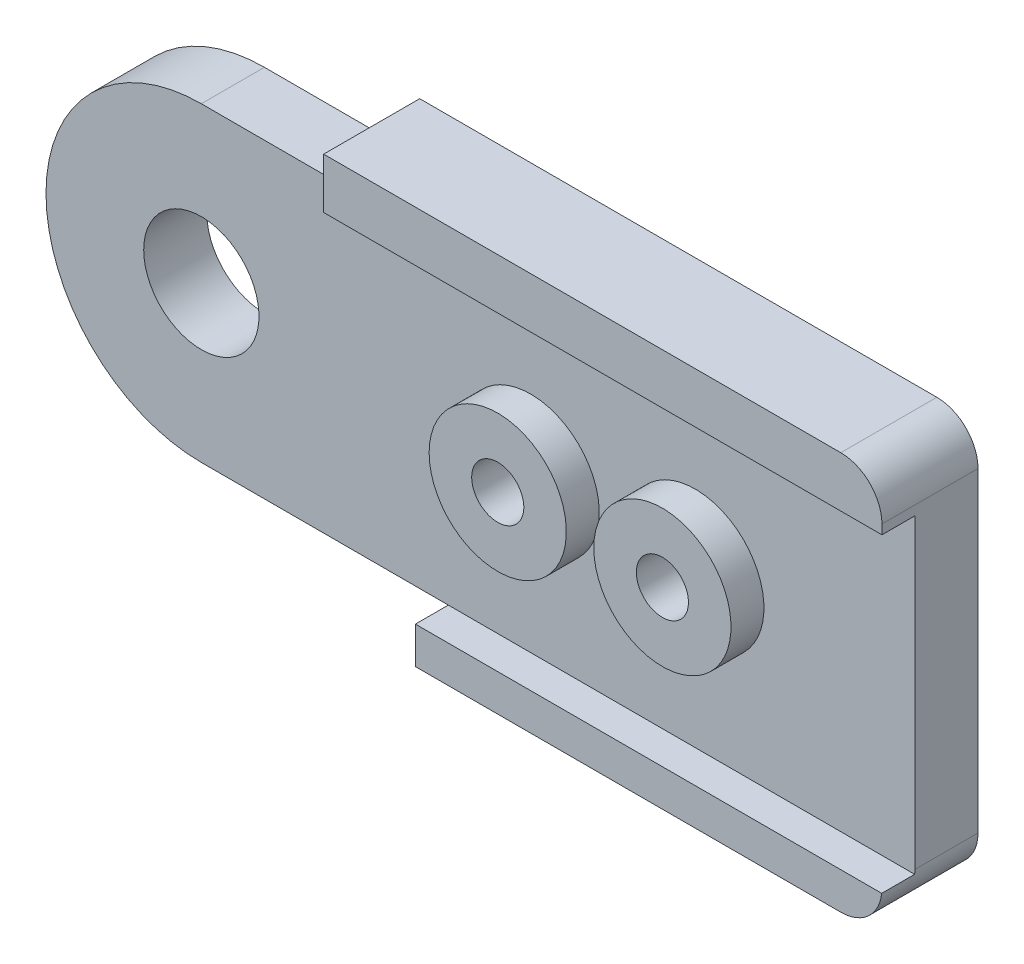
ISO-10303-21;
HEADER;
FILE_DESCRIPTION(('STEP AP214'),'2;1');
FILE_NAME('part.step','',(''),(''),'','','');
FILE_SCHEMA(('AUTOMOTIVE_DESIGN { 1 0 10303 214 1 1 1 1 }'));
ENDSEC;
DATA;
#1=APPLICATION_CONTEXT('core data for automotive mechanical design processes');
#2=APPLICATION_PROTOCOL_DEFINITION('international standard','automotive_design',2000,#1);
#3=PRODUCT_CONTEXT('',#1,'mechanical');
#4=PRODUCT('Part','Part','',(#3));
#5=PRODUCT_RELATED_PRODUCT_CATEGORY('part','',(#4));
#6=PRODUCT_DEFINITION_FORMATION('','',#4);
#7=PRODUCT_DEFINITION_CONTEXT('part definition',#1,'design');
#8=PRODUCT_DEFINITION('design','',#6,#7);
#9=PRODUCT_DEFINITION_SHAPE('','',#8);
#10=(LENGTH_UNIT() NAMED_UNIT(*) SI_UNIT(.MILLI.,.METRE.));
#11=(NAMED_UNIT(*) PLANE_ANGLE_UNIT() SI_UNIT($,.RADIAN.));
#12=(NAMED_UNIT(*) SI_UNIT($,.STERADIAN.) SOLID_ANGLE_UNIT());
#13=UNCERTAINTY_MEASURE_WITH_UNIT(LENGTH_MEASURE(1.E-05),#10,'distance_accuracy_value','');
#14=(GEOMETRIC_REPRESENTATION_CONTEXT(3) GLOBAL_UNCERTAINTY_ASSIGNED_CONTEXT((#13)) GLOBAL_UNIT_ASSIGNED_CONTEXT((#10,
#11,#12)) REPRESENTATION_CONTEXT('',''));
#15=CARTESIAN_POINT('',(0.,0.,0.));
#16=DIRECTION('',(0.,0.,1.));
#17=DIRECTION('',(1.,0.,0.));
#18=AXIS2_PLACEMENT_3D('',#15,#16,#17);
#19=CARTESIAN_POINT('',(0.,0.,-9.5));
#20=DIRECTION('',(0.,0.,-1.));
#21=DIRECTION('',(-1.,0.,0.));
#22=AXIS2_PLACEMENT_3D('',#19,#20,#21);
#23=PLANE('',#22);
#24=DIRECTION('',(0.999999845465009,-0.000555940607591913,0.));
#25=VECTOR('',#24,1.);
#26=CARTESIAN_POINT('',(0.00314662286624039,5.65999737563121,-9.5));
#27=LINE('',#26,#25);
#28=CARTESIAN_POINT('',(0.,5.65999912496691,-9.5));
#29=VERTEX_POINT('',#28);
#30=CARTESIAN_POINT('',(5.65685424949238,5.65685424949239,-9.5));
#31=VERTEX_POINT('',#30);
#32=EDGE_CURVE('E226',#29,#31,#27,.T.);
#33=ORIENTED_EDGE('',*,*,#32,.T.);
#34=DIRECTION('',(0.,1.,0.));
#35=VECTOR('',#34,1.);
#36=CARTESIAN_POINT('',(5.65685424949238,5.65685424949239,-9.5));
#37=LINE('',#36,#35);
#38=CARTESIAN_POINT('',(5.65685424949238,7.49836473471238,-9.5));
#39=VERTEX_POINT('',#38);
#40=EDGE_CURVE('E166',#31,#39,#37,.T.);
#41=ORIENTED_EDGE('',*,*,#40,.T.);
#42=DIRECTION('',(1.,0.,0.));
#43=VECTOR('',#42,1.);
#44=CARTESIAN_POINT('',(5.65685424949238,7.49836473471238,-9.5));
#45=LINE('',#44,#43);
#46=CARTESIAN_POINT('',(24.5,7.49836473471239,-9.5));
#47=VERTEX_POINT('',#46);
#48=EDGE_CURVE('E162',#39,#47,#45,.T.);
#49=ORIENTED_EDGE('',*,*,#48,.T.);
#50=CARTESIAN_POINT('',(24.5,5.99836473471239,-9.5));
#51=DIRECTION('',(0.,0.,-1.));
#52=DIRECTION('',(-1.,0.,0.));
#53=AXIS2_PLACEMENT_3D('',#50,#51,#52);
#54=CIRCLE('',#53,1.5);
#55=CARTESIAN_POINT('',(26.,5.99836473471239,-9.5));
#56=VERTEX_POINT('',#55);
#57=EDGE_CURVE('E137',#56,#47,#54,.F.);
#58=ORIENTED_EDGE('',*,*,#57,.F.);
#59=DIRECTION('',(0.,-1.,0.));
#60=VECTOR('',#59,1.);
#61=CARTESIAN_POINT('',(26.,0.,-9.5));
#62=LINE('',#61,#60);
#63=CARTESIAN_POINT('',(26.,-5.50163526528755,-9.5));
#64=VERTEX_POINT('',#63);
#65=EDGE_CURVE('E104',#56,#64,#62,.T.);
#66=ORIENTED_EDGE('',*,*,#65,.T.);
#67=CARTESIAN_POINT('',(24.5,-5.50163526528755,-9.5));
#68=DIRECTION('',(0.,0.,-1.));
#69=DIRECTION('',(-1.,0.,0.));
#70=AXIS2_PLACEMENT_3D('',#67,#68,#69);
#71=CIRCLE('',#70,1.5);
#72=CARTESIAN_POINT('',(24.5,-7.00163526528755,-9.5));
#73=VERTEX_POINT('',#72);
#74=EDGE_CURVE('E142',#73,#64,#71,.F.);
#75=ORIENTED_EDGE('',*,*,#74,.F.);
#76=DIRECTION('',(-1.,0.,0.));
#77=VECTOR('',#76,1.);
#78=CARTESIAN_POINT('',(26.,-7.00163526528755,-9.5));
#79=LINE('',#78,#77);
#80=CARTESIAN_POINT('',(9.00000000000001,-7.00163526528755,-9.5));
#81=VERTEX_POINT('',#80);
#82=EDGE_CURVE('E158',#73,#81,#79,.T.);
#83=ORIENTED_EDGE('',*,*,#82,.T.);
#84=DIRECTION('',(0.,1.,0.));
#85=VECTOR('',#84,1.);
#86=CARTESIAN_POINT('',(9.00000000000001,-7.00163526528755,-9.5));
#87=LINE('',#86,#85);
#88=CARTESIAN_POINT('',(9.00000000000001,-5.6599991249669,-9.5));
#89=VERTEX_POINT('',#88);
#90=EDGE_CURVE('E154',#81,#89,#87,.T.);
#91=ORIENTED_EDGE('',*,*,#90,.T.);
#92=DIRECTION('',(-1.,0.,0.));
#93=VECTOR('',#92,1.);
#94=CARTESIAN_POINT('',(0.,-5.6599991249669,-9.5));
#95=LINE('',#94,#93);
#96=CARTESIAN_POINT('',(0.,-5.6599991249669,-9.5));
#97=VERTEX_POINT('',#96);
#98=EDGE_CURVE('E123',#89,#97,#95,.T.);
#99=ORIENTED_EDGE('',*,*,#98,.T.);
#100=CARTESIAN_POINT('',(0.,0.,-9.5));
#101=DIRECTION('',(0.,0.,-1.));
#102=DIRECTION('',(-1.,0.,0.));
#103=AXIS2_PLACEMENT_3D('',#100,#101,#102);
#104=CIRCLE('',#103,5.65999868763295);
#105=EDGE_CURVE('E90',#97,#29,#104,.T.);
#106=ORIENTED_EDGE('',*,*,#105,.T.);
#107=EDGE_LOOP('',(#33,#41,#49,#58,#66,#75,#83,#91,#99,#106));
#108=FACE_BOUND('',#107,.T.);
#109=CARTESIAN_POINT('',(18.,0.,-9.5));
#110=DIRECTION('',(0.,0.,-1.));
#111=DIRECTION('',(-1.,0.,0.));
#112=AXIS2_PLACEMENT_3D('',#109,#110,#111);
#113=CIRCLE('',#112,0.950000000000001);
#114=CARTESIAN_POINT('',(17.05,0.,-9.5));
#115=VERTEX_POINT('',#114);
#116=EDGE_CURVE('E146',#115,#115,#113,.F.);
#117=ORIENTED_EDGE('',*,*,#116,.T.);
#118=EDGE_LOOP('',(#117));
#119=FACE_BOUND('',#118,.T.);
#120=CARTESIAN_POINT('',(12.,0.,-9.5));
#121=DIRECTION('',(0.,0.,-1.));
#122=DIRECTION('',(-1.,0.,0.));
#123=AXIS2_PLACEMENT_3D('',#120,#121,#122);
#124=CIRCLE('',#123,0.949999999999999);
#125=CARTESIAN_POINT('',(11.05,0.,-9.5));
#126=VERTEX_POINT('',#125);
#127=EDGE_CURVE('E150',#126,#126,#124,.F.);
#128=ORIENTED_EDGE('',*,*,#127,.T.);
#129=EDGE_LOOP('',(#128));
#130=FACE_BOUND('',#129,.T.);
#131=CARTESIAN_POINT('',(0.,0.,-9.5));
#132=DIRECTION('',(0.,0.,-1.));
#133=DIRECTION('',(-1.,0.,0.));
#134=AXIS2_PLACEMENT_3D('',#131,#132,#133);
#135=CIRCLE('',#134,2.1);
#136=CARTESIAN_POINT('',(-2.1,0.,-9.5));
#137=VERTEX_POINT('',#136);
#138=EDGE_CURVE('E118',#137,#137,#135,.T.);
#139=ORIENTED_EDGE('',*,*,#138,.F.);
#140=EDGE_LOOP('',(#139));
#141=FACE_BOUND('',#140,.T.);
#142=ADVANCED_FACE('F40',(#108,#119,#130,#141),#23,.T.);
#143=CARTESIAN_POINT('',(12.,0.,-6.));
#144=DIRECTION('',(0.,0.,1.));
#145=DIRECTION('',(1.,0.,0.));
#146=AXIS2_PLACEMENT_3D('',#143,#144,#145);
#147=CYLINDRICAL_SURFACE('',#146,2.5);
#148=CARTESIAN_POINT('',(12.,0.,-6.));
#149=DIRECTION('',(0.,0.,-1.));
#150=DIRECTION('',(-1.,0.,0.));
#151=AXIS2_PLACEMENT_3D('',#148,#149,#150);
#152=CIRCLE('',#151,2.5);
#153=CARTESIAN_POINT('',(9.50000000000001,0.,-6.));
#154=VERTEX_POINT('',#153);
#155=EDGE_CURVE('E386',#154,#154,#152,.T.);
#156=ORIENTED_EDGE('',*,*,#155,.T.);
#157=EDGE_LOOP('',(#156));
#158=FACE_BOUND('',#157,.T.);
#159=CARTESIAN_POINT('',(12.,0.,-7.2));
#160=DIRECTION('',(0.,0.,-1.));
#161=DIRECTION('',(-1.,0.,0.));
#162=AXIS2_PLACEMENT_3D('',#159,#160,#161);
#163=CIRCLE('',#162,2.5);
#164=CARTESIAN_POINT('',(9.50000000000001,0.,-7.2));
#165=VERTEX_POINT('',#164);
#166=EDGE_CURVE('E127',#165,#165,#163,.T.);
#167=ORIENTED_EDGE('',*,*,#166,.F.);
#168=EDGE_LOOP('',(#167));
#169=FACE_BOUND('',#168,.T.);
#170=ADVANCED_FACE('F304',(#158,#169),#147,.T.);
#171=CARTESIAN_POINT('',(18.,0.,-6.));
#172=DIRECTION('',(0.,0.,1.));
#173=DIRECTION('',(1.,0.,0.));
#174=AXIS2_PLACEMENT_3D('',#171,#172,#173);
#175=CYLINDRICAL_SURFACE('',#174,2.5);
#176=CARTESIAN_POINT('',(18.,0.,-6.));
#177=DIRECTION('',(0.,0.,-1.));
#178=DIRECTION('',(-1.,0.,0.));
#179=AXIS2_PLACEMENT_3D('',#176,#177,#178);
#180=CIRCLE('',#179,2.5);
#181=CARTESIAN_POINT('',(15.5,0.,-6.));
#182=VERTEX_POINT('',#181);
#183=EDGE_CURVE('E380',#182,#182,#180,.T.);
#184=ORIENTED_EDGE('',*,*,#183,.T.);
#185=EDGE_LOOP('',(#184));
#186=FACE_BOUND('',#185,.T.);
#187=CARTESIAN_POINT('',(18.,0.,-7.2));
#188=DIRECTION('',(0.,0.,-1.));
#189=DIRECTION('',(-1.,0.,0.));
#190=AXIS2_PLACEMENT_3D('',#187,#188,#189);
#191=CIRCLE('',#190,2.5);
#192=CARTESIAN_POINT('',(15.5,0.,-7.2));
#193=VERTEX_POINT('',#192);
#194=EDGE_CURVE('E131',#193,#193,#191,.T.);
#195=ORIENTED_EDGE('',*,*,#194,.F.);
#196=EDGE_LOOP('',(#195));
#197=FACE_BOUND('',#196,.T.);
#198=ADVANCED_FACE('F306',(#186,#197),#175,.T.);
#199=CARTESIAN_POINT('',(0.,0.,-6.));
#200=DIRECTION('',(0.,0.,-1.));
#201=DIRECTION('',(-1.,0.,0.));
#202=AXIS2_PLACEMENT_3D('',#199,#200,#201);
#203=PLANE('',#202);
#204=DIRECTION('',(-1.,0.,0.));
#205=VECTOR('',#204,1.);
#206=CARTESIAN_POINT('',(26.,-7.00163526528755,-6.));
#207=LINE('',#206,#205);
#208=CARTESIAN_POINT('',(24.5,-7.00163526528755,-6.));
#209=VERTEX_POINT('',#208);
#210=CARTESIAN_POINT('',(9.00000000000001,-7.00163526528755,-6.));
#211=VERTEX_POINT('',#210);
#212=EDGE_CURVE('E373',#209,#211,#207,.T.);
#213=ORIENTED_EDGE('',*,*,#212,.F.);
#214=CARTESIAN_POINT('',(24.5,-5.50163526528755,-6.));
#215=DIRECTION('',(0.,0.,-1.));
#216=DIRECTION('',(-1.,0.,0.));
#217=AXIS2_PLACEMENT_3D('',#214,#215,#216);
#218=CIRCLE('',#217,1.5);
#219=CARTESIAN_POINT('',(25.9916168703616,-5.6599991249669,-6.));
#220=VERTEX_POINT('',#219);
#221=EDGE_CURVE('E393',#209,#220,#218,.F.);
#222=ORIENTED_EDGE('',*,*,#221,.T.);
#223=DIRECTION('',(1.,0.,0.));
#224=VECTOR('',#223,1.);
#225=CARTESIAN_POINT('',(9.00000000000001,-5.6599991249669,-6.));
#226=LINE('',#225,#224);
#227=CARTESIAN_POINT('',(9.00000000000001,-5.6599991249669,-6.));
#228=VERTEX_POINT('',#227);
#229=EDGE_CURVE('E175',#228,#220,#226,.T.);
#230=ORIENTED_EDGE('',*,*,#229,.F.);
#231=DIRECTION('',(0.,1.,0.));
#232=VECTOR('',#231,1.);
#233=CARTESIAN_POINT('',(9.00000000000001,-7.00163526528755,-6.));
#234=LINE('',#233,#232);
#235=EDGE_CURVE('E408',#211,#228,#234,.T.);
#236=ORIENTED_EDGE('',*,*,#235,.F.);
#237=EDGE_LOOP('',(#213,#222,#230,#236));
#238=FACE_BOUND('',#237,.T.);
#239=ADVANCED_FACE('F313',(#238),#203,.F.);
#240=CARTESIAN_POINT('',(9.00000000000001,-5.6599991249669,-6.));
#241=DIRECTION('',(0.,-1.,0.));
#242=DIRECTION('',(1.,0.,0.));
#243=AXIS2_PLACEMENT_3D('',#240,#241,#242);
#244=PLANE('',#243);
#245=DIRECTION('',(0.,0.,1.));
#246=VECTOR('',#245,1.);
#247=CARTESIAN_POINT('',(9.00000000000001,-5.6599991249669,-6.));
#248=LINE('',#247,#246);
#249=CARTESIAN_POINT('',(9.00000000000001,-5.6599991249669,-7.2));
#250=VERTEX_POINT('',#249);
#251=EDGE_CURVE('E203',#250,#228,#248,.T.);
#252=ORIENTED_EDGE('',*,*,#251,.T.);
#253=ORIENTED_EDGE('',*,*,#229,.T.);
#254=DIRECTION('',(0.,0.,-1.));
#255=VECTOR('',#254,1.);
#256=CARTESIAN_POINT('',(25.9916168703616,-5.6599991249669,-4.8));
#257=LINE('',#256,#255);
#258=CARTESIAN_POINT('',(25.9916168703616,-5.6599991249669,-7.2));
#259=VERTEX_POINT('',#258);
#260=EDGE_CURVE('E179',#220,#259,#257,.T.);
#261=ORIENTED_EDGE('',*,*,#260,.T.);
#262=DIRECTION('',(1.,0.,0.));
#263=VECTOR('',#262,1.);
#264=CARTESIAN_POINT('',(9.00000000000001,-5.6599991249669,-7.2));
#265=LINE('',#264,#263);
#266=EDGE_CURVE('E11',#250,#259,#265,.T.);
#267=ORIENTED_EDGE('',*,*,#266,.F.);
#268=EDGE_LOOP('',(#252,#253,#261,#267));
#269=FACE_BOUND('',#268,.T.);
#270=ADVANCED_FACE('F329',(#269),#244,.F.);
#271=CARTESIAN_POINT('',(26.,-7.00163526528755,2.));
#272=DIRECTION('',(0.,1.,0.));
#273=DIRECTION('',(-1.,0.,0.));
#274=AXIS2_PLACEMENT_3D('',#271,#272,#273);
#275=PLANE('',#274);
#276=ORIENTED_EDGE('',*,*,#82,.F.);
#277=DIRECTION('',(0.,0.,-1.));
#278=VECTOR('',#277,1.);
#279=CARTESIAN_POINT('',(24.5,-7.00163526528755,2.));
#280=LINE('',#279,#278);
#281=EDGE_CURVE('E174',#73,#209,#280,.F.);
#282=ORIENTED_EDGE('',*,*,#281,.T.);
#283=ORIENTED_EDGE('',*,*,#212,.T.);
#284=DIRECTION('',(0.,0.,-1.));
#285=VECTOR('',#284,1.);
#286=CARTESIAN_POINT('',(9.00000000000001,-7.00163526528755,2.));
#287=LINE('',#286,#285);
#288=EDGE_CURVE('E184',#211,#81,#287,.T.);
#289=ORIENTED_EDGE('',*,*,#288,.T.);
#290=EDGE_LOOP('',(#276,#282,#283,#289));
#291=FACE_BOUND('',#290,.T.);
#292=ADVANCED_FACE('F331',(#291),#275,.F.);
#293=CARTESIAN_POINT('',(5.65685424949238,7.49836473471238,2.));
#294=DIRECTION('',(0.,-1.,0.));
#295=DIRECTION('',(1.,0.,0.));
#296=AXIS2_PLACEMENT_3D('',#293,#294,#295);
#297=PLANE('',#296);
#298=ORIENTED_EDGE('',*,*,#48,.F.);
#299=DIRECTION('',(0.,0.,-1.));
#300=VECTOR('',#299,1.);
#301=CARTESIAN_POINT('',(5.65685424949238,7.49836473471238,2.));
#302=LINE('',#301,#300);
#303=CARTESIAN_POINT('',(5.65685424949238,7.49836473471238,-6.));
#304=VERTEX_POINT('',#303);
#305=EDGE_CURVE('E187',#304,#39,#302,.T.);
#306=ORIENTED_EDGE('',*,*,#305,.F.);
#307=DIRECTION('',(1.,0.,0.));
#308=VECTOR('',#307,1.);
#309=CARTESIAN_POINT('',(5.65685424949238,7.49836473471238,-6.));
#310=LINE('',#309,#308);
#311=CARTESIAN_POINT('',(24.5,7.49836473471239,-6.));
#312=VERTEX_POINT('',#311);
#313=EDGE_CURVE('E372',#304,#312,#310,.T.);
#314=ORIENTED_EDGE('',*,*,#313,.T.);
#315=DIRECTION('',(0.,0.,-1.));
#316=VECTOR('',#315,1.);
#317=CARTESIAN_POINT('',(24.5,7.49836473471239,2.));
#318=LINE('',#317,#316);
#319=EDGE_CURVE('E170',#312,#47,#318,.T.);
#320=ORIENTED_EDGE('',*,*,#319,.T.);
#321=EDGE_LOOP('',(#298,#306,#314,#320));
#322=FACE_BOUND('',#321,.T.);
#323=ADVANCED_FACE('F353',(#322),#297,.F.);
#324=CARTESIAN_POINT('',(24.5,-5.50163526528755,2.));
#325=DIRECTION('',(0.,0.,-1.));
#326=DIRECTION('',(-1.,0.,0.));
#327=AXIS2_PLACEMENT_3D('',#324,#325,#326);
#328=CYLINDRICAL_SURFACE('',#327,1.5);
#329=ORIENTED_EDGE('',*,*,#281,.F.);
#330=ORIENTED_EDGE('',*,*,#74,.T.);
#331=DIRECTION('',(0.,0.,1.));
#332=VECTOR('',#331,1.);
#333=CARTESIAN_POINT('',(26.,-5.50163526528755,-14.));
#334=LINE('',#333,#332);
#335=CARTESIAN_POINT('',(26.,-5.50163526528755,-7.2));
#336=VERTEX_POINT('',#335);
#337=EDGE_CURVE('E44',#64,#336,#334,.T.);
#338=ORIENTED_EDGE('',*,*,#337,.T.);
#339=CARTESIAN_POINT('',(24.5,-5.50163526528755,-7.2));
#340=DIRECTION('',(0.,0.,-1.));
#341=DIRECTION('',(-1.,0.,0.));
#342=AXIS2_PLACEMENT_3D('',#339,#340,#341);
#343=CIRCLE('',#342,1.5);
#344=EDGE_CURVE('E211',#336,#259,#343,.T.);
#345=ORIENTED_EDGE('',*,*,#344,.T.);
#346=ORIENTED_EDGE('',*,*,#260,.F.);
#347=ORIENTED_EDGE('',*,*,#221,.F.);
#348=EDGE_LOOP('',(#329,#330,#338,#345,#346,#347));
#349=FACE_BOUND('',#348,.T.);
#350=ADVANCED_FACE('F244',(#349),#328,.T.);
#351=CARTESIAN_POINT('',(9.00000000000001,-7.00163526528755,2.));
#352=DIRECTION('',(1.,0.,0.));
#353=DIRECTION('',(0.,0.,-1.));
#354=AXIS2_PLACEMENT_3D('',#351,#352,#353);
#355=PLANE('',#354);
#356=ORIENTED_EDGE('',*,*,#90,.F.);
#357=ORIENTED_EDGE('',*,*,#288,.F.);
#358=ORIENTED_EDGE('',*,*,#235,.T.);
#359=ORIENTED_EDGE('',*,*,#251,.F.);
#360=DIRECTION('',(0.,0.,-1.));
#361=VECTOR('',#360,1.);
#362=CARTESIAN_POINT('',(9.00000000000001,-5.6599991249669,-7.2));
#363=LINE('',#362,#361);
#364=EDGE_CURVE('E100',#250,#89,#363,.T.);
#365=ORIENTED_EDGE('',*,*,#364,.T.);
#366=EDGE_LOOP('',(#356,#357,#358,#359,#365));
#367=FACE_BOUND('',#366,.T.);
#368=ADVANCED_FACE('F301',(#367),#355,.F.);
#369=CARTESIAN_POINT('',(0.,-5.6599991249669,-7.2));
#370=DIRECTION('',(0.,1.,0.));
#371=DIRECTION('',(0.,0.,-1.));
#372=AXIS2_PLACEMENT_3D('',#369,#370,#371);
#373=PLANE('',#372);
#374=ORIENTED_EDGE('',*,*,#98,.F.);
#375=ORIENTED_EDGE('',*,*,#364,.F.);
#376=DIRECTION('',(-1.,0.,0.));
#377=VECTOR('',#376,1.);
#378=CARTESIAN_POINT('',(0.,-5.6599991249669,-7.2));
#379=LINE('',#378,#377);
#380=CARTESIAN_POINT('',(0.,-5.6599991249669,-7.2));
#381=VERTEX_POINT('',#380);
#382=EDGE_CURVE('E97',#250,#381,#379,.T.);
#383=ORIENTED_EDGE('',*,*,#382,.T.);
#384=DIRECTION('',(0.,0.,-1.));
#385=VECTOR('',#384,1.);
#386=CARTESIAN_POINT('',(0.,-5.6599991249669,-7.2));
#387=LINE('',#386,#385);
#388=EDGE_CURVE('E67',#381,#97,#387,.T.);
#389=ORIENTED_EDGE('',*,*,#388,.T.);
#390=EDGE_LOOP('',(#374,#375,#383,#389));
#391=FACE_BOUND('',#390,.T.);
#392=ADVANCED_FACE('F98',(#391),#373,.F.);
#393=CARTESIAN_POINT('',(5.65685424949238,5.65685424949239,2.));
#394=DIRECTION('',(1.,0.,0.));
#395=DIRECTION('',(0.,0.,-1.));
#396=AXIS2_PLACEMENT_3D('',#393,#394,#395);
#397=PLANE('',#396);
#398=ORIENTED_EDGE('',*,*,#40,.F.);
#399=DIRECTION('',(0.,0.,-1.));
#400=VECTOR('',#399,1.);
#401=CARTESIAN_POINT('',(5.65685424949238,5.65685424949239,-7.2));
#402=LINE('',#401,#400);
#403=CARTESIAN_POINT('',(5.65685424949238,5.65685424949239,-7.2));
#404=VERTEX_POINT('',#403);
#405=EDGE_CURVE('E217',#404,#31,#402,.T.);
#406=ORIENTED_EDGE('',*,*,#405,.F.);
#407=DIRECTION('',(0.,0.,1.));
#408=VECTOR('',#407,1.);
#409=CARTESIAN_POINT('',(5.65685424949238,5.65685424949239,-6.));
#410=LINE('',#409,#408);
#411=CARTESIAN_POINT('',(5.65685424949238,5.65685424949239,-6.));
#412=VERTEX_POINT('',#411);
#413=EDGE_CURVE('E190',#404,#412,#410,.T.);
#414=ORIENTED_EDGE('',*,*,#413,.T.);
#415=DIRECTION('',(0.,1.,0.));
#416=VECTOR('',#415,1.);
#417=CARTESIAN_POINT('',(5.65685424949238,5.65685424949239,-6.));
#418=LINE('',#417,#416);
#419=EDGE_CURVE('E378',#412,#304,#418,.T.);
#420=ORIENTED_EDGE('',*,*,#419,.T.);
#421=ORIENTED_EDGE('',*,*,#305,.T.);
#422=EDGE_LOOP('',(#398,#406,#414,#420,#421));
#423=FACE_BOUND('',#422,.T.);
#424=ADVANCED_FACE('F291',(#423),#397,.F.);
#425=CARTESIAN_POINT('',(0.,0.,-7.2));
#426=DIRECTION('',(0.,0.,1.));
#427=DIRECTION('',(-1.,0.,0.));
#428=AXIS2_PLACEMENT_3D('',#425,#426,#427);
#429=PLANE('',#428);
#430=ORIENTED_EDGE('',*,*,#194,.T.);
#431=EDGE_LOOP('',(#430));
#432=FACE_BOUND('',#431,.T.);
#433=ORIENTED_EDGE('',*,*,#166,.T.);
#434=EDGE_LOOP('',(#433));
#435=FACE_BOUND('',#434,.T.);
#436=CARTESIAN_POINT('',(0.,0.,-7.2));
#437=DIRECTION('',(0.,0.,-1.));
#438=DIRECTION('',(-1.,0.,0.));
#439=AXIS2_PLACEMENT_3D('',#436,#437,#438);
#440=CIRCLE('',#439,2.1);
#441=CARTESIAN_POINT('',(-2.1,0.,-7.2));
#442=VERTEX_POINT('',#441);
#443=EDGE_CURVE('E122',#442,#442,#440,.T.);
#444=ORIENTED_EDGE('',*,*,#443,.T.);
#445=EDGE_LOOP('',(#444));
#446=FACE_BOUND('',#445,.T.);
#447=DIRECTION('',(0.,-1.,0.));
#448=VECTOR('',#447,1.);
#449=CARTESIAN_POINT('',(26.,0.,-7.2));
#450=LINE('',#449,#448);
#451=CARTESIAN_POINT('',(26.,5.65685424949239,-7.2));
#452=VERTEX_POINT('',#451);
#453=EDGE_CURVE('E114',#452,#336,#450,.T.);
#454=ORIENTED_EDGE('',*,*,#453,.F.);
#455=DIRECTION('',(-1.,0.,0.));
#456=VECTOR('',#455,1.);
#457=CARTESIAN_POINT('',(26.,5.65685424949239,-7.2));
#458=LINE('',#457,#456);
#459=EDGE_CURVE('E50',#452,#404,#458,.T.);
#460=ORIENTED_EDGE('',*,*,#459,.T.);
#461=DIRECTION('',(0.999999845465009,-0.000555940607591913,0.));
#462=VECTOR('',#461,1.);
#463=CARTESIAN_POINT('',(0.00314662286624039,5.65999737563121,-7.2));
#464=LINE('',#463,#462);
#465=CARTESIAN_POINT('',(0.,5.65999912496691,-7.2));
#466=VERTEX_POINT('',#465);
#467=EDGE_CURVE('E110',#466,#404,#464,.T.);
#468=ORIENTED_EDGE('',*,*,#467,.F.);
#469=CARTESIAN_POINT('',(0.,0.,-7.2));
#470=DIRECTION('',(0.,0.,-1.));
#471=DIRECTION('',(-1.,0.,0.));
#472=AXIS2_PLACEMENT_3D('',#469,#470,#471);
#473=CIRCLE('',#472,5.65999868763295);
#474=EDGE_CURVE('E87',#381,#466,#473,.T.);
#475=ORIENTED_EDGE('',*,*,#474,.F.);
#476=ORIENTED_EDGE('',*,*,#382,.F.);
#477=ORIENTED_EDGE('',*,*,#266,.T.);
#478=ORIENTED_EDGE('',*,*,#344,.F.);
#479=EDGE_LOOP('',(#454,#460,#468,#475,#476,#477,#478));
#480=FACE_BOUND('',#479,.T.);
#481=ADVANCED_FACE('F107',(#432,#435,#446,#480),#429,.T.);
#482=CARTESIAN_POINT('',(0.,0.,-9.7));
#483=DIRECTION('',(0.,0.,1.));
#484=DIRECTION('',(-1.,0.,0.));
#485=AXIS2_PLACEMENT_3D('',#482,#483,#484);
#486=CYLINDRICAL_SURFACE('',#485,2.1);
#487=ORIENTED_EDGE('',*,*,#443,.F.);
#488=EDGE_LOOP('',(#487));
#489=FACE_BOUND('',#488,.T.);
#490=ORIENTED_EDGE('',*,*,#138,.T.);
#491=EDGE_LOOP('',(#490));
#492=FACE_BOUND('',#491,.T.);
#493=ADVANCED_FACE('F298',(#489,#492),#486,.F.);
#494=CARTESIAN_POINT('',(0.,0.,-7.2));
#495=DIRECTION('',(0.,0.,-1.));
#496=DIRECTION('',(1.,0.,0.));
#497=AXIS2_PLACEMENT_3D('',#494,#495,#496);
#498=CYLINDRICAL_SURFACE('',#497,5.65999868763295);
#499=ORIENTED_EDGE('',*,*,#105,.F.);
#500=ORIENTED_EDGE('',*,*,#388,.F.);
#501=ORIENTED_EDGE('',*,*,#474,.T.);
#502=DIRECTION('',(0.,0.,-1.));
#503=VECTOR('',#502,1.);
#504=CARTESIAN_POINT('',(0.,5.65999912496691,-7.2));
#505=LINE('',#504,#503);
#506=EDGE_CURVE('E93',#466,#29,#505,.T.);
#507=ORIENTED_EDGE('',*,*,#506,.T.);
#508=EDGE_LOOP('',(#499,#500,#501,#507));
#509=FACE_BOUND('',#508,.T.);
#510=ADVANCED_FACE('F85',(#509),#498,.T.);
#511=CARTESIAN_POINT('',(0.00314662286624039,5.65999737563121,-7.2));
#512=DIRECTION('',(-0.000555940607591913,-0.999999845465008,0.));
#513=DIRECTION('',(0.999999845465009,-0.000555940607591913,0.));
#514=AXIS2_PLACEMENT_3D('',#511,#512,#513);
#515=PLANE('',#514);
#516=ORIENTED_EDGE('',*,*,#32,.F.);
#517=ORIENTED_EDGE('',*,*,#506,.F.);
#518=ORIENTED_EDGE('',*,*,#467,.T.);
#519=ORIENTED_EDGE('',*,*,#405,.T.);
#520=EDGE_LOOP('',(#516,#517,#518,#519));
#521=FACE_BOUND('',#520,.T.);
#522=ADVANCED_FACE('F288',(#521),#515,.F.);
#523=CARTESIAN_POINT('',(26.,5.65685424949239,-6.));
#524=DIRECTION('',(0.,1.,0.));
#525=DIRECTION('',(-1.,0.,0.));
#526=AXIS2_PLACEMENT_3D('',#523,#524,#525);
#527=PLANE('',#526);
#528=DIRECTION('',(0.,0.,1.));
#529=VECTOR('',#528,1.);
#530=CARTESIAN_POINT('',(26.,5.65685424949239,-6.));
#531=LINE('',#530,#529);
#532=CARTESIAN_POINT('',(26.,5.65685424949239,-6.));
#533=VERTEX_POINT('',#532);
#534=EDGE_CURVE('E58',#452,#533,#531,.T.);
#535=ORIENTED_EDGE('',*,*,#534,.T.);
#536=DIRECTION('',(-1.,0.,0.));
#537=VECTOR('',#536,1.);
#538=CARTESIAN_POINT('',(26.,5.65685424949239,-6.));
#539=LINE('',#538,#537);
#540=EDGE_CURVE('E376',#533,#412,#539,.T.);
#541=ORIENTED_EDGE('',*,*,#540,.T.);
#542=ORIENTED_EDGE('',*,*,#413,.F.);
#543=ORIENTED_EDGE('',*,*,#459,.F.);
#544=EDGE_LOOP('',(#535,#541,#542,#543));
#545=FACE_BOUND('',#544,.T.);
#546=ADVANCED_FACE('F324',(#545),#527,.F.);
#547=ORIENTED_EDGE('',*,*,#540,.F.);
#548=DIRECTION('',(0.,-1.,0.));
#549=VECTOR('',#548,1.);
#550=CARTESIAN_POINT('',(26.,-7.00163526528755,-6.));
#551=LINE('',#550,#549);
#552=CARTESIAN_POINT('',(26.,5.99836473471239,-6.));
#553=VERTEX_POINT('',#552);
#554=EDGE_CURVE('E368',#553,#533,#551,.T.);
#555=ORIENTED_EDGE('',*,*,#554,.F.);
#556=CARTESIAN_POINT('',(24.5,5.99836473471239,-6.));
#557=DIRECTION('',(0.,0.,-1.));
#558=DIRECTION('',(-1.,0.,0.));
#559=AXIS2_PLACEMENT_3D('',#556,#557,#558);
#560=CIRCLE('',#559,1.5);
#561=EDGE_CURVE('E141',#553,#312,#560,.F.);
#562=ORIENTED_EDGE('',*,*,#561,.T.);
#563=ORIENTED_EDGE('',*,*,#313,.F.);
#564=ORIENTED_EDGE('',*,*,#419,.F.);
#565=EDGE_LOOP('',(#547,#555,#562,#563,#564));
#566=FACE_BOUND('',#565,.T.);
#567=ADVANCED_FACE('F327',(#566),#203,.F.);
#568=CARTESIAN_POINT('',(24.5,5.99836473471239,2.));
#569=DIRECTION('',(0.,0.,-1.));
#570=DIRECTION('',(-1.,0.,0.));
#571=AXIS2_PLACEMENT_3D('',#568,#569,#570);
#572=CYLINDRICAL_SURFACE('',#571,1.5);
#573=DIRECTION('',(0.,0.,-1.));
#574=VECTOR('',#573,1.);
#575=CARTESIAN_POINT('',(26.,5.99836473471239,2.));
#576=LINE('',#575,#574);
#577=EDGE_CURVE('E180',#56,#553,#576,.F.);
#578=ORIENTED_EDGE('',*,*,#577,.F.);
#579=ORIENTED_EDGE('',*,*,#57,.T.);
#580=ORIENTED_EDGE('',*,*,#319,.F.);
#581=ORIENTED_EDGE('',*,*,#561,.F.);
#582=EDGE_LOOP('',(#578,#579,#580,#581));
#583=FACE_BOUND('',#582,.T.);
#584=ADVANCED_FACE('F42',(#583),#572,.T.);
#585=CARTESIAN_POINT('',(26.,-7.00163526528755,2.));
#586=DIRECTION('',(-1.,0.,0.));
#587=DIRECTION('',(0.,0.,1.));
#588=AXIS2_PLACEMENT_3D('',#585,#586,#587);
#589=PLANE('',#588);
#590=ORIENTED_EDGE('',*,*,#65,.F.);
#591=ORIENTED_EDGE('',*,*,#577,.T.);
#592=ORIENTED_EDGE('',*,*,#554,.T.);
#593=ORIENTED_EDGE('',*,*,#534,.F.);
#594=ORIENTED_EDGE('',*,*,#453,.T.);
#595=ORIENTED_EDGE('',*,*,#337,.F.);
#596=EDGE_LOOP('',(#590,#591,#592,#593,#594,#595));
#597=FACE_BOUND('',#596,.T.);
#598=ADVANCED_FACE('F236',(#597),#589,.F.);
#599=ORIENTED_EDGE('',*,*,#155,.F.);
#600=EDGE_LOOP('',(#599));
#601=FACE_BOUND('',#600,.T.);
#602=CARTESIAN_POINT('',(12.,0.,-6.));
#603=DIRECTION('',(0.,0.,-1.));
#604=DIRECTION('',(-1.,0.,0.));
#605=AXIS2_PLACEMENT_3D('',#602,#603,#604);
#606=CIRCLE('',#605,0.949999999999999);
#607=CARTESIAN_POINT('',(11.05,0.,-6.));
#608=VERTEX_POINT('',#607);
#609=EDGE_CURVE('E402',#608,#608,#606,.F.);
#610=ORIENTED_EDGE('',*,*,#609,.F.);
#611=EDGE_LOOP('',(#610));
#612=FACE_BOUND('',#611,.T.);
#613=ADVANCED_FACE('F346',(#601,#612),#203,.F.);
#614=CARTESIAN_POINT('',(12.,0.,3.2));
#615=DIRECTION('',(0.,0.,-1.));
#616=DIRECTION('',(-1.,0.,0.));
#617=AXIS2_PLACEMENT_3D('',#614,#615,#616);
#618=CYLINDRICAL_SURFACE('',#617,0.949999999999999);
#619=ORIENTED_EDGE('',*,*,#609,.T.);
#620=EDGE_LOOP('',(#619));
#621=FACE_BOUND('',#620,.T.);
#622=ORIENTED_EDGE('',*,*,#127,.F.);
#623=EDGE_LOOP('',(#622));
#624=FACE_BOUND('',#623,.T.);
#625=ADVANCED_FACE('F343',(#621,#624),#618,.F.);
#626=ORIENTED_EDGE('',*,*,#183,.F.);
#627=EDGE_LOOP('',(#626));
#628=FACE_BOUND('',#627,.T.);
#629=CARTESIAN_POINT('',(18.,0.,-6.));
#630=DIRECTION('',(0.,0.,-1.));
#631=DIRECTION('',(-1.,0.,0.));
#632=AXIS2_PLACEMENT_3D('',#629,#630,#631);
#633=CIRCLE('',#632,0.950000000000001);
#634=CARTESIAN_POINT('',(17.05,0.,-6.));
#635=VERTEX_POINT('',#634);
#636=EDGE_CURVE('E396',#635,#635,#633,.F.);
#637=ORIENTED_EDGE('',*,*,#636,.F.);
#638=EDGE_LOOP('',(#637));
#639=FACE_BOUND('',#638,.T.);
#640=ADVANCED_FACE('F322',(#628,#639),#203,.F.);
#641=CARTESIAN_POINT('',(18.,0.,3.2));
#642=DIRECTION('',(0.,0.,-1.));
#643=DIRECTION('',(-1.,0.,0.));
#644=AXIS2_PLACEMENT_3D('',#641,#642,#643);
#645=CYLINDRICAL_SURFACE('',#644,0.950000000000001);
#646=ORIENTED_EDGE('',*,*,#636,.T.);
#647=EDGE_LOOP('',(#646));
#648=FACE_BOUND('',#647,.T.);
#649=ORIENTED_EDGE('',*,*,#116,.F.);
#650=EDGE_LOOP('',(#649));
#651=FACE_BOUND('',#650,.T.);
#652=ADVANCED_FACE('F318',(#648,#651),#645,.F.);
#653=CLOSED_SHELL('',(#142,#170,#198,#239,#270,#292,#323,#350,#368,#392,#424,#481,#493,#510,
#522,#546,#567,#584,#598,#613,#625,#640,#652));
#654=MANIFOLD_SOLID_BREP('B2',#653);
#655=ADVANCED_BREP_SHAPE_REPRESENTATION('',(#18,#654),#14);
#656=SHAPE_DEFINITION_REPRESENTATION(#9,#655);
ENDSEC;
END-ISO-10303-21;
